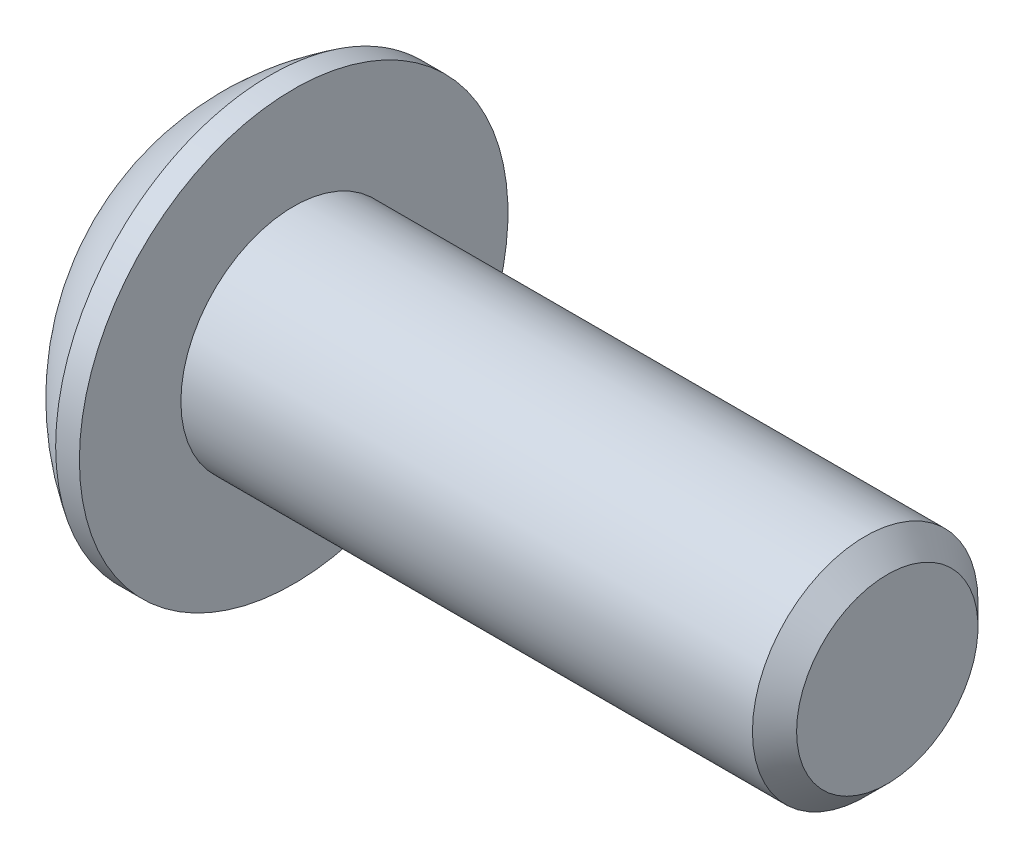
ISO-10303-21;
HEADER;
FILE_DESCRIPTION(('STEP AP214'),'2;1');
FILE_NAME('part.step','',(''),(''),'','','');
FILE_SCHEMA(('AUTOMOTIVE_DESIGN { 1 0 10303 214 1 1 1 1 }'));
ENDSEC;
DATA;
#1=APPLICATION_CONTEXT('core data for automotive mechanical design processes');
#2=APPLICATION_PROTOCOL_DEFINITION('international standard','automotive_design',2000,#1);
#3=PRODUCT_CONTEXT('',#1,'mechanical');
#4=PRODUCT('Part','Part','',(#3));
#5=PRODUCT_RELATED_PRODUCT_CATEGORY('part','',(#4));
#6=PRODUCT_DEFINITION_FORMATION('','',#4);
#7=PRODUCT_DEFINITION_CONTEXT('part definition',#1,'design');
#8=PRODUCT_DEFINITION('design','',#6,#7);
#9=PRODUCT_DEFINITION_SHAPE('','',#8);
#10=(LENGTH_UNIT() NAMED_UNIT(*) SI_UNIT(.MILLI.,.METRE.));
#11=(NAMED_UNIT(*) PLANE_ANGLE_UNIT() SI_UNIT($,.RADIAN.));
#12=(NAMED_UNIT(*) SI_UNIT($,.STERADIAN.) SOLID_ANGLE_UNIT());
#13=UNCERTAINTY_MEASURE_WITH_UNIT(LENGTH_MEASURE(1.E-05),#10,'distance_accuracy_value','');
#14=(GEOMETRIC_REPRESENTATION_CONTEXT(3) GLOBAL_UNCERTAINTY_ASSIGNED_CONTEXT((#13)) GLOBAL_UNIT_ASSIGNED_CONTEXT((#10,
#11,#12)) REPRESENTATION_CONTEXT('',''));
#15=CARTESIAN_POINT('',(0.,0.,0.));
#16=DIRECTION('',(0.,0.,1.));
#17=DIRECTION('',(1.,0.,0.));
#18=AXIS2_PLACEMENT_3D('',#15,#16,#17);
#19=CARTESIAN_POINT('',(1.77800000000017,0.,0.));
#20=DIRECTION('',(-1.,0.,0.));
#21=DIRECTION('',(0.,0.,1.));
#22=AXIS2_PLACEMENT_3D('',#19,#20,#21);
#23=CONICAL_SURFACE('',#22,1.58749999999985,1.04719755119662);
#24=CARTESIAN_POINT('',(2.69454355233856,0.,0.));
#25=VERTEX_POINT('',#24);
#26=VERTEX_LOOP('',#25);
#27=FACE_BOUND('',#26,.T.);
#28=CARTESIAN_POINT('',(1.77800000000017,0.,0.));
#29=DIRECTION('',(-1.,0.,0.));
#30=DIRECTION('',(0.,0.,1.));
#31=AXIS2_PLACEMENT_3D('',#28,#29,#30);
#32=CIRCLE('',#31,1.58749999999985);
#33=CARTESIAN_POINT('',(1.77800000000008,0.,1.58749999999993));
#34=VERTEX_POINT('',#33);
#35=CARTESIAN_POINT('',(1.77800000000008,-1.37481532850773,0.793749999999965));
#36=VERTEX_POINT('',#35);
#37=EDGE_CURVE('E19',#34,#36,#32,.F.);
#38=ORIENTED_EDGE('',*,*,#37,.F.);
#39=CARTESIAN_POINT('',(1.77800000000017,0.,0.));
#40=DIRECTION('',(-1.,0.,0.));
#41=DIRECTION('',(0.,0.,1.));
#42=AXIS2_PLACEMENT_3D('',#39,#40,#41);
#43=CIRCLE('',#42,1.58749999999985);
#44=CARTESIAN_POINT('',(1.77800000000008,1.37481532850773,0.793749999999963));
#45=VERTEX_POINT('',#44);
#46=EDGE_CURVE('E89',#34,#45,#43,.T.);
#47=ORIENTED_EDGE('',*,*,#46,.T.);
#48=CARTESIAN_POINT('',(1.77800000000017,0.,0.));
#49=DIRECTION('',(-1.,0.,0.));
#50=DIRECTION('',(0.,0.,1.));
#51=AXIS2_PLACEMENT_3D('',#48,#49,#50);
#52=CIRCLE('',#51,1.58749999999985);
#53=CARTESIAN_POINT('',(1.77800000000008,1.37481532850773,-0.793749999999963));
#54=VERTEX_POINT('',#53);
#55=EDGE_CURVE('E105',#45,#54,#52,.T.);
#56=ORIENTED_EDGE('',*,*,#55,.T.);
#57=CARTESIAN_POINT('',(1.77800000000017,0.,0.));
#58=DIRECTION('',(-1.,0.,0.));
#59=DIRECTION('',(0.,0.,1.));
#60=AXIS2_PLACEMENT_3D('',#57,#58,#59);
#61=CIRCLE('',#60,1.58749999999985);
#62=CARTESIAN_POINT('',(1.77800000000008,2.13833679173112E-12,-1.58749999999993));
#63=VERTEX_POINT('',#62);
#64=EDGE_CURVE('E448',#54,#63,#61,.T.);
#65=ORIENTED_EDGE('',*,*,#64,.T.);
#66=CARTESIAN_POINT('',(1.77800000000017,0.,0.));
#67=DIRECTION('',(-1.,0.,0.));
#68=DIRECTION('',(0.,0.,1.));
#69=AXIS2_PLACEMENT_3D('',#66,#67,#68);
#70=CIRCLE('',#69,1.58749999999985);
#71=CARTESIAN_POINT('',(1.77800000000008,-1.37481532850773,-0.793749999999965));
#72=VERTEX_POINT('',#71);
#73=EDGE_CURVE('E450',#72,#63,#70,.F.);
#74=ORIENTED_EDGE('',*,*,#73,.F.);
#75=CARTESIAN_POINT('',(1.77800000000017,0.,0.));
#76=DIRECTION('',(-1.,0.,0.));
#77=DIRECTION('',(0.,0.,1.));
#78=AXIS2_PLACEMENT_3D('',#75,#76,#77);
#79=CIRCLE('',#78,1.58749999999985);
#80=EDGE_CURVE('E92',#36,#72,#79,.F.);
#81=ORIENTED_EDGE('',*,*,#80,.F.);
#82=EDGE_LOOP('',(#38,#47,#56,#65,#74,#81));
#83=FACE_BOUND('',#82,.T.);
#84=ADVANCED_FACE('F16',(#27,#83),#23,.F.);
#85=CARTESIAN_POINT('',(1.778,-1.83308710467706,0.));
#86=DIRECTION('',(1.,0.,0.));
#87=DIRECTION('',(0.,0.,-1.));
#88=AXIS2_PLACEMENT_3D('',#85,#86,#87);
#89=PLANE('',#88);
#90=DIRECTION('',(0.,0.500000000000001,0.866025403784438));
#91=VECTOR('',#90,1.);
#92=CARTESIAN_POINT('',(1.778,-1.83308710467706,0.));
#93=LINE('',#92,#91);
#94=CARTESIAN_POINT('',(1.778,-0.91654355233853,1.5875));
#95=VERTEX_POINT('',#94);
#96=EDGE_CURVE('E110',#95,#36,#93,.F.);
#97=ORIENTED_EDGE('',*,*,#96,.F.);
#98=DIRECTION('',(0.,1.,0.));
#99=VECTOR('',#98,1.);
#100=CARTESIAN_POINT('',(1.778,-0.916543552338531,1.5875));
#101=LINE('',#100,#99);
#102=EDGE_CURVE('E108',#34,#95,#101,.F.);
#103=ORIENTED_EDGE('',*,*,#102,.F.);
#104=ORIENTED_EDGE('',*,*,#37,.T.);
#105=EDGE_LOOP('',(#97,#103,#104));
#106=FACE_BOUND('',#105,.T.);
#107=ADVANCED_FACE('F109',(#106),#89,.F.);
#108=CARTESIAN_POINT('',(1.778,-1.83308710467706,0.));
#109=DIRECTION('',(1.,0.,0.));
#110=DIRECTION('',(0.,0.,-1.));
#111=AXIS2_PLACEMENT_3D('',#108,#109,#110);
#112=PLANE('',#111);
#113=DIRECTION('',(0.,-0.500000000000001,0.866025403784438));
#114=VECTOR('',#113,1.);
#115=CARTESIAN_POINT('',(1.778,-0.916543552338531,-1.5875));
#116=LINE('',#115,#114);
#117=CARTESIAN_POINT('',(1.778,-1.83308710467706,0.));
#118=VERTEX_POINT('',#117);
#119=EDGE_CURVE('E158',#118,#72,#116,.F.);
#120=ORIENTED_EDGE('',*,*,#119,.F.);
#121=DIRECTION('',(0.,0.500000000000001,0.866025403784438));
#122=VECTOR('',#121,1.);
#123=CARTESIAN_POINT('',(1.778,-1.83308710467706,0.));
#124=LINE('',#123,#122);
#125=EDGE_CURVE('E170',#36,#118,#124,.F.);
#126=ORIENTED_EDGE('',*,*,#125,.F.);
#127=ORIENTED_EDGE('',*,*,#80,.T.);
#128=EDGE_LOOP('',(#120,#126,#127));
#129=FACE_BOUND('',#128,.T.);
#130=ADVANCED_FACE('F247',(#129),#112,.F.);
#131=CARTESIAN_POINT('',(1.778,-1.83308710467706,0.));
#132=DIRECTION('',(1.,0.,0.));
#133=DIRECTION('',(0.,0.,-1.));
#134=AXIS2_PLACEMENT_3D('',#131,#132,#133);
#135=PLANE('',#134);
#136=DIRECTION('',(0.,1.,0.));
#137=VECTOR('',#136,1.);
#138=CARTESIAN_POINT('',(1.778,0.91654355233853,-1.5875));
#139=LINE('',#138,#137);
#140=CARTESIAN_POINT('',(1.778,-0.916543552338531,-1.5875));
#141=VERTEX_POINT('',#140);
#142=EDGE_CURVE('E142',#141,#63,#139,.T.);
#143=ORIENTED_EDGE('',*,*,#142,.F.);
#144=DIRECTION('',(0.,-0.500000000000001,0.866025403784438));
#145=VECTOR('',#144,1.);
#146=CARTESIAN_POINT('',(1.778,-0.916543552338531,-1.5875));
#147=LINE('',#146,#145);
#148=EDGE_CURVE('E155',#72,#141,#147,.F.);
#149=ORIENTED_EDGE('',*,*,#148,.F.);
#150=ORIENTED_EDGE('',*,*,#73,.T.);
#151=EDGE_LOOP('',(#143,#149,#150));
#152=FACE_BOUND('',#151,.T.);
#153=ADVANCED_FACE('F243',(#152),#135,.F.);
#154=CARTESIAN_POINT('',(1.778,-1.83308710467706,0.));
#155=DIRECTION('',(1.,0.,0.));
#156=DIRECTION('',(0.,0.,-1.));
#157=AXIS2_PLACEMENT_3D('',#154,#155,#156);
#158=PLANE('',#157);
#159=DIRECTION('',(0.,-0.5,-0.866025403784439));
#160=VECTOR('',#159,1.);
#161=CARTESIAN_POINT('',(1.778,1.83308710467706,0.));
#162=LINE('',#161,#160);
#163=CARTESIAN_POINT('',(1.778,0.916543552338531,-1.5875));
#164=VERTEX_POINT('',#163);
#165=EDGE_CURVE('E127',#164,#54,#162,.F.);
#166=ORIENTED_EDGE('',*,*,#165,.F.);
#167=DIRECTION('',(0.,1.,0.));
#168=VECTOR('',#167,1.);
#169=CARTESIAN_POINT('',(1.778,0.91654355233853,-1.5875));
#170=LINE('',#169,#168);
#171=EDGE_CURVE('E139',#63,#164,#170,.T.);
#172=ORIENTED_EDGE('',*,*,#171,.F.);
#173=ORIENTED_EDGE('',*,*,#64,.F.);
#174=EDGE_LOOP('',(#166,#172,#173));
#175=FACE_BOUND('',#174,.T.);
#176=ADVANCED_FACE('F239',(#175),#158,.F.);
#177=CARTESIAN_POINT('',(1.778,-1.83308710467706,0.));
#178=DIRECTION('',(1.,0.,0.));
#179=DIRECTION('',(0.,0.,-1.));
#180=AXIS2_PLACEMENT_3D('',#177,#178,#179);
#181=PLANE('',#180);
#182=DIRECTION('',(0.,0.5,-0.866025403784439));
#183=VECTOR('',#182,1.);
#184=CARTESIAN_POINT('',(1.778,0.916543552338531,1.5875));
#185=LINE('',#184,#183);
#186=CARTESIAN_POINT('',(1.778,1.83308710467706,0.));
#187=VERTEX_POINT('',#186);
#188=EDGE_CURVE('E147',#187,#45,#185,.F.);
#189=ORIENTED_EDGE('',*,*,#188,.F.);
#190=DIRECTION('',(0.,-0.5,-0.866025403784439));
#191=VECTOR('',#190,1.);
#192=CARTESIAN_POINT('',(1.778,1.83308710467706,0.));
#193=LINE('',#192,#191);
#194=EDGE_CURVE('E124',#54,#187,#193,.F.);
#195=ORIENTED_EDGE('',*,*,#194,.F.);
#196=ORIENTED_EDGE('',*,*,#55,.F.);
#197=EDGE_LOOP('',(#189,#195,#196));
#198=FACE_BOUND('',#197,.T.);
#199=ADVANCED_FACE('F236',(#198),#181,.F.);
#200=CARTESIAN_POINT('',(1.778,-1.83308710467706,0.));
#201=DIRECTION('',(1.,0.,0.));
#202=DIRECTION('',(0.,0.,-1.));
#203=AXIS2_PLACEMENT_3D('',#200,#201,#202);
#204=PLANE('',#203);
#205=DIRECTION('',(0.,1.,0.));
#206=VECTOR('',#205,1.);
#207=CARTESIAN_POINT('',(1.778,-0.916543552338531,1.5875));
#208=LINE('',#207,#206);
#209=CARTESIAN_POINT('',(1.778,0.91654355233853,1.5875));
#210=VERTEX_POINT('',#209);
#211=EDGE_CURVE('E100',#210,#34,#208,.F.);
#212=ORIENTED_EDGE('',*,*,#211,.F.);
#213=DIRECTION('',(0.,0.5,-0.866025403784439));
#214=VECTOR('',#213,1.);
#215=CARTESIAN_POINT('',(1.778,0.916543552338531,1.5875));
#216=LINE('',#215,#214);
#217=EDGE_CURVE('E103',#45,#210,#216,.F.);
#218=ORIENTED_EDGE('',*,*,#217,.F.);
#219=ORIENTED_EDGE('',*,*,#46,.F.);
#220=EDGE_LOOP('',(#212,#218,#219));
#221=FACE_BOUND('',#220,.T.);
#222=ADVANCED_FACE('F98',(#221),#204,.F.);
#223=CARTESIAN_POINT('',(1.778,-0.916543552338531,1.5875));
#224=DIRECTION('',(0.,0.,-1.));
#225=DIRECTION('',(0.,1.,0.));
#226=AXIS2_PLACEMENT_3D('',#223,#224,#225);
#227=PLANE('',#226);
#228=DIRECTION('',(0.,1.,0.));
#229=VECTOR('',#228,1.);
#230=CARTESIAN_POINT('',(0.,0.,1.5875));
#231=LINE('',#230,#229);
#232=CARTESIAN_POINT('',(0.,0.91654355233853,1.5875));
#233=VERTEX_POINT('',#232);
#234=CARTESIAN_POINT('',(0.,-0.91654355233853,1.5875));
#235=VERTEX_POINT('',#234);
#236=EDGE_CURVE('E131',#233,#235,#231,.F.);
#237=ORIENTED_EDGE('',*,*,#236,.F.);
#238=DIRECTION('',(1.,0.,0.));
#239=VECTOR('',#238,1.);
#240=CARTESIAN_POINT('',(1.778,0.916543552338531,1.5875));
#241=LINE('',#240,#239);
#242=EDGE_CURVE('E116',#210,#233,#241,.F.);
#243=ORIENTED_EDGE('',*,*,#242,.F.);
#244=ORIENTED_EDGE('',*,*,#211,.T.);
#245=ORIENTED_EDGE('',*,*,#102,.T.);
#246=DIRECTION('',(1.,0.,0.));
#247=VECTOR('',#246,1.);
#248=CARTESIAN_POINT('',(1.778,-0.91654355233853,1.5875));
#249=LINE('',#248,#247);
#250=EDGE_CURVE('E167',#235,#95,#249,.T.);
#251=ORIENTED_EDGE('',*,*,#250,.F.);
#252=EDGE_LOOP('',(#237,#243,#244,#245,#251));
#253=FACE_BOUND('',#252,.T.);
#254=ADVANCED_FACE('F114',(#253),#227,.T.);
#255=CARTESIAN_POINT('',(1.778,-1.83308710467706,0.));
#256=DIRECTION('',(0.,0.866025403784438,-0.500000000000001));
#257=DIRECTION('',(0.,0.500000000000001,0.866025403784438));
#258=AXIS2_PLACEMENT_3D('',#255,#256,#257);
#259=PLANE('',#258);
#260=DIRECTION('',(0.,-0.500000000000001,-0.866025403784438));
#261=VECTOR('',#260,1.);
#262=CARTESIAN_POINT('',(0.,-0.916543552338531,1.5875));
#263=LINE('',#262,#261);
#264=CARTESIAN_POINT('',(0.,-1.83308710467706,0.));
#265=VERTEX_POINT('',#264);
#266=EDGE_CURVE('E434',#235,#265,#263,.T.);
#267=ORIENTED_EDGE('',*,*,#266,.F.);
#268=ORIENTED_EDGE('',*,*,#250,.T.);
#269=ORIENTED_EDGE('',*,*,#96,.T.);
#270=ORIENTED_EDGE('',*,*,#125,.T.);
#271=DIRECTION('',(1.,0.,0.));
#272=VECTOR('',#271,1.);
#273=CARTESIAN_POINT('',(1.778,-1.83308710467706,0.));
#274=LINE('',#273,#272);
#275=EDGE_CURVE('E152',#265,#118,#274,.T.);
#276=ORIENTED_EDGE('',*,*,#275,.F.);
#277=EDGE_LOOP('',(#267,#268,#269,#270,#276));
#278=FACE_BOUND('',#277,.T.);
#279=ADVANCED_FACE('F227',(#278),#259,.T.);
#280=CARTESIAN_POINT('',(1.778,-0.916543552338531,-1.5875));
#281=DIRECTION('',(0.,0.866025403784438,0.500000000000001));
#282=DIRECTION('',(0.,-0.500000000000001,0.866025403784438));
#283=AXIS2_PLACEMENT_3D('',#280,#281,#282);
#284=PLANE('',#283);
#285=DIRECTION('',(0.,0.500000000000001,-0.866025403784438));
#286=VECTOR('',#285,1.);
#287=CARTESIAN_POINT('',(0.,-1.83308710467706,0.));
#288=LINE('',#287,#286);
#289=CARTESIAN_POINT('',(0.,-0.916543552338531,-1.5875));
#290=VERTEX_POINT('',#289);
#291=EDGE_CURVE('E431',#265,#290,#288,.T.);
#292=ORIENTED_EDGE('',*,*,#291,.F.);
#293=ORIENTED_EDGE('',*,*,#275,.T.);
#294=ORIENTED_EDGE('',*,*,#119,.T.);
#295=ORIENTED_EDGE('',*,*,#148,.T.);
#296=DIRECTION('',(1.,0.,0.));
#297=VECTOR('',#296,1.);
#298=CARTESIAN_POINT('',(1.778,-0.916543552338531,-1.5875));
#299=LINE('',#298,#297);
#300=EDGE_CURVE('E136',#290,#141,#299,.T.);
#301=ORIENTED_EDGE('',*,*,#300,.F.);
#302=EDGE_LOOP('',(#292,#293,#294,#295,#301));
#303=FACE_BOUND('',#302,.T.);
#304=ADVANCED_FACE('F223',(#303),#284,.T.);
#305=CARTESIAN_POINT('',(1.778,0.91654355233853,-1.5875));
#306=DIRECTION('',(0.,0.,1.));
#307=DIRECTION('',(1.,0.,0.));
#308=AXIS2_PLACEMENT_3D('',#305,#306,#307);
#309=PLANE('',#308);
#310=DIRECTION('',(0.,1.,0.));
#311=VECTOR('',#310,1.);
#312=CARTESIAN_POINT('',(0.,0.,-1.5875));
#313=LINE('',#312,#311);
#314=CARTESIAN_POINT('',(0.,0.91654355233853,-1.5875));
#315=VERTEX_POINT('',#314);
#316=EDGE_CURVE('E428',#290,#315,#313,.T.);
#317=ORIENTED_EDGE('',*,*,#316,.F.);
#318=ORIENTED_EDGE('',*,*,#300,.T.);
#319=ORIENTED_EDGE('',*,*,#142,.T.);
#320=ORIENTED_EDGE('',*,*,#171,.T.);
#321=DIRECTION('',(1.,0.,0.));
#322=VECTOR('',#321,1.);
#323=CARTESIAN_POINT('',(1.778,0.91654355233853,-1.5875));
#324=LINE('',#323,#322);
#325=EDGE_CURVE('E126',#315,#164,#324,.T.);
#326=ORIENTED_EDGE('',*,*,#325,.F.);
#327=EDGE_LOOP('',(#317,#318,#319,#320,#326));
#328=FACE_BOUND('',#327,.T.);
#329=ADVANCED_FACE('F220',(#328),#309,.T.);
#330=CARTESIAN_POINT('',(1.778,1.83308710467706,0.));
#331=DIRECTION('',(0.,-0.866025403784439,0.5));
#332=DIRECTION('',(0.,-0.5,-0.866025403784439));
#333=AXIS2_PLACEMENT_3D('',#330,#331,#332);
#334=PLANE('',#333);
#335=DIRECTION('',(0.,0.5,0.866025403784439));
#336=VECTOR('',#335,1.);
#337=CARTESIAN_POINT('',(0.,0.91654355233853,-1.5875));
#338=LINE('',#337,#336);
#339=CARTESIAN_POINT('',(0.,1.83308710467706,0.));
#340=VERTEX_POINT('',#339);
#341=EDGE_CURVE('E425',#315,#340,#338,.T.);
#342=ORIENTED_EDGE('',*,*,#341,.F.);
#343=ORIENTED_EDGE('',*,*,#325,.T.);
#344=ORIENTED_EDGE('',*,*,#165,.T.);
#345=ORIENTED_EDGE('',*,*,#194,.T.);
#346=DIRECTION('',(1.,0.,0.));
#347=VECTOR('',#346,1.);
#348=CARTESIAN_POINT('',(1.778,1.83308710467706,0.));
#349=LINE('',#348,#347);
#350=EDGE_CURVE('E34',#340,#187,#349,.T.);
#351=ORIENTED_EDGE('',*,*,#350,.F.);
#352=EDGE_LOOP('',(#342,#343,#344,#345,#351));
#353=FACE_BOUND('',#352,.T.);
#354=ADVANCED_FACE('F216',(#353),#334,.T.);
#355=CARTESIAN_POINT('',(1.778,0.916543552338531,1.5875));
#356=DIRECTION('',(0.,-0.866025403784439,-0.5));
#357=DIRECTION('',(0.,0.5,-0.866025403784439));
#358=AXIS2_PLACEMENT_3D('',#355,#356,#357);
#359=PLANE('',#358);
#360=DIRECTION('',(0.,-0.5,0.866025403784439));
#361=VECTOR('',#360,1.);
#362=CARTESIAN_POINT('',(0.,1.83308710467706,0.));
#363=LINE('',#362,#361);
#364=EDGE_CURVE('E202',#340,#233,#363,.T.);
#365=ORIENTED_EDGE('',*,*,#364,.F.);
#366=ORIENTED_EDGE('',*,*,#350,.T.);
#367=ORIENTED_EDGE('',*,*,#188,.T.);
#368=ORIENTED_EDGE('',*,*,#217,.T.);
#369=ORIENTED_EDGE('',*,*,#242,.T.);
#370=EDGE_LOOP('',(#365,#366,#367,#368,#369));
#371=FACE_BOUND('',#370,.T.);
#372=ADVANCED_FACE('F212',(#371),#359,.T.);
#373=CARTESIAN_POINT('',(0.,0.,0.));
#374=DIRECTION('',(-1.,0.,0.));
#375=DIRECTION('',(0.,0.,1.));
#376=AXIS2_PLACEMENT_3D('',#373,#374,#375);
#377=PLANE('',#376);
#378=ORIENTED_EDGE('',*,*,#341,.T.);
#379=ORIENTED_EDGE('',*,*,#364,.T.);
#380=ORIENTED_EDGE('',*,*,#236,.T.);
#381=ORIENTED_EDGE('',*,*,#266,.T.);
#382=ORIENTED_EDGE('',*,*,#291,.T.);
#383=ORIENTED_EDGE('',*,*,#316,.T.);
#384=EDGE_LOOP('',(#378,#379,#380,#381,#382,#383));
#385=FACE_BOUND('',#384,.T.);
#386=CARTESIAN_POINT('',(0.,2.29235,0.));
#387=CARTESIAN_POINT('',(0.,2.29234961429956,0.0643619991867156));
#388=CARTESIAN_POINT('',(0.,2.28963695190107,0.128735826629365));
#389=CARTESIAN_POINT('',(0.,2.27880393843647,0.257038618985286));
#390=CARTESIAN_POINT('',(0.,2.27068199085126,0.320967446929162));
#391=CARTESIAN_POINT('',(0.,2.24906694794255,0.448021254607716));
#392=CARTESIAN_POINT('',(-2.10473483966727E-13,2.2355653265346,0.511144793381859));
#393=CARTESIAN_POINT('',(2.11512355009136E-13,2.20328400495643,0.636065176149319));
#394=CARTESIAN_POINT('',(7.88547714490058E-13,2.18450002159113,0.697860899533932));
#395=CARTESIAN_POINT('',(1.31038865418015E-12,2.12048422735802,0.880329802927745));
#396=CARTESIAN_POINT('',(0.,2.06753599079458,0.998391795928114));
#397=CARTESIAN_POINT('',(0.,1.94254204858672,1.22393765942147));
#398=CARTESIAN_POINT('',(1.0944863984612E-12,1.87049561696642,1.33142112758208));
#399=CARTESIAN_POINT('',(6.78157167000121E-13,1.7497425419488,1.48237719670935));
#400=CARTESIAN_POINT('',(1.81954057270124E-13,1.707345731323,1.53101280076737));
#401=CARTESIAN_POINT('',(-1.80911682549526E-13,1.61863910291528,1.62450601319184));
#402=CARTESIAN_POINT('',(0.,1.57233309727312,1.66936721890417));
#403=CARTESIAN_POINT('',(0.,1.47608431707233,1.7550488420402));
#404=CARTESIAN_POINT('',(0.,1.42613990458993,1.79586741981511));
#405=CARTESIAN_POINT('',(0.,1.3229945254125,1.87315615311522));
#406=CARTESIAN_POINT('',(0.,1.26979280714187,1.90962529930696));
#407=CARTESIAN_POINT('',(0.,1.10588180153952,2.01207722151089));
#408=CARTESIAN_POINT('',(0.,0.990764947001308,2.07119486286666));
#409=CARTESIAN_POINT('',(0.,0.752302198839713,2.16922858468855));
#410=CARTESIAN_POINT('',(0.,0.628956393121256,2.20814488091449));
#411=CARTESIAN_POINT('',(0.,0.377466101733266,2.26472755765919));
#412=CARTESIAN_POINT('',(0.,0.249321590440377,2.28239382469378));
#413=CARTESIAN_POINT('',(0.,-0.00811435371610854,2.29595665980955));
#414=CARTESIAN_POINT('',(0.,-0.137405786579706,2.29185322789072));
#415=CARTESIAN_POINT('',(0.,-0.393449386933725,2.26200962409059));
#416=CARTESIAN_POINT('',(0.,-0.520201567981082,2.23626956775766));
#417=CARTESIAN_POINT('',(0.,-0.767645294384449,2.16383549332686));
#418=CARTESIAN_POINT('',(0.,-0.888336774993553,2.11714125142684));
#419=CARTESIAN_POINT('',(0.,-1.06210572146656,2.03247976453653));
#420=CARTESIAN_POINT('',(0.,-1.11884498714066,2.00180278323694));
#421=CARTESIAN_POINT('',(0.,-1.22954062855573,1.93578011658035));
#422=CARTESIAN_POINT('',(0.,-1.28349764565393,1.9004355139425));
#423=CARTESIAN_POINT('',(0.,-1.38821676641538,1.82534174602347));
#424=CARTESIAN_POINT('',(0.,-1.43898030563029,1.78559458231503));
#425=CARTESIAN_POINT('',(0.,-1.53701984534431,1.70193996292361));
#426=CARTESIAN_POINT('',(0.,-1.58429243280551,1.65802852924126));
#427=CARTESIAN_POINT('',(0.,-1.72023903553758,1.52059650554138));
#428=CARTESIAN_POINT('',(0.,-1.80318066138239,1.42127847626519));
#429=CARTESIAN_POINT('',(0.,-1.95118232345098,1.21011519784663));
#430=CARTESIAN_POINT('',(0.,-2.01624303935584,1.09827042509272));
#431=CARTESIAN_POINT('',(0.,-2.09907772661315,0.923538238005834));
#432=CARTESIAN_POINT('',(0.,-2.12425103063558,0.864058373981962));
#433=CARTESIAN_POINT('',(0.,-2.16947990046565,0.743221562175597));
#434=CARTESIAN_POINT('',(0.,-2.18953960800684,0.681866178863361));
#435=CARTESIAN_POINT('',(0.,-2.22438542051156,0.557786972400354));
#436=CARTESIAN_POINT('',(0.,-2.23917985294818,0.495065478128169));
#437=CARTESIAN_POINT('',(0.,-2.26343456384453,0.368611258323513));
#438=CARTESIAN_POINT('',(0.,-2.27289641559286,0.304878836759567));
#439=CARTESIAN_POINT('',(0.,-2.28388649696736,0.200873029360624));
#440=CARTESIAN_POINT('',(0.,-2.28705930623293,0.160766164180097));
#441=CARTESIAN_POINT('',(0.,-2.29129117827044,0.0804410725432706));
#442=CARTESIAN_POINT('',(0.,-2.29235024104238,0.0402228460869713));
#443=CARTESIAN_POINT('',(0.,-2.29234961429957,-0.0643619991867166));
#444=CARTESIAN_POINT('',(0.,-2.28963695190107,-0.128735826629366));
#445=CARTESIAN_POINT('',(0.,-2.27880393843647,-0.257038618985287));
#446=CARTESIAN_POINT('',(0.,-2.27068199085126,-0.320967446929163));
#447=CARTESIAN_POINT('',(0.,-2.24906694794255,-0.448021254607718));
#448=CARTESIAN_POINT('',(-2.10776055808131E-13,-2.2355653265346,-0.511144793381862));
#449=CARTESIAN_POINT('',(2.11815172901383E-13,-2.20328400495643,-0.636065176149322));
#450=CARTESIAN_POINT('',(7.89841960011606E-13,-2.18450002159113,-0.697860899533935));
#451=CARTESIAN_POINT('',(1.31300223385862E-12,-2.12048422735802,-0.880329802927749));
#452=CARTESIAN_POINT('',(0.,-2.06753599079458,-0.998391795928116));
#453=CARTESIAN_POINT('',(0.,-1.94254204858672,-1.22393765942147));
#454=CARTESIAN_POINT('',(1.09190336088254E-12,-1.87049561696642,-1.33142112758208));
#455=CARTESIAN_POINT('',(6.76847156379684E-13,-1.74974254194879,-1.48237719670935));
#456=CARTESIAN_POINT('',(1.81603200486814E-13,-1.707345731323,-1.53101280076737));
#457=CARTESIAN_POINT('',(-1.80561164044999E-13,-1.61863910291528,-1.62450601319185));
#458=CARTESIAN_POINT('',(0.,-1.57233309727312,-1.66936721890417));
#459=CARTESIAN_POINT('',(0.,-1.47608431707233,-1.7550488420402));
#460=CARTESIAN_POINT('',(0.,-1.42613990458993,-1.79586741981511));
#461=CARTESIAN_POINT('',(0.,-1.3229945254125,-1.87315615311522));
#462=CARTESIAN_POINT('',(0.,-1.26979280714187,-1.90962529930697));
#463=CARTESIAN_POINT('',(0.,-1.10588180153952,-2.0120772215109));
#464=CARTESIAN_POINT('',(0.,-0.990764947001305,-2.07119486286666));
#465=CARTESIAN_POINT('',(0.,-0.752302198839709,-2.16922858468855));
#466=CARTESIAN_POINT('',(0.,-0.628956393121251,-2.20814488091449));
#467=CARTESIAN_POINT('',(0.,-0.377466101733262,-2.26472755765919));
#468=CARTESIAN_POINT('',(0.,-0.249321590440373,-2.28239382469378));
#469=CARTESIAN_POINT('',(0.,0.00811435371611301,-2.29595665980954));
#470=CARTESIAN_POINT('',(0.,0.13740578657971,-2.29185322789071));
#471=CARTESIAN_POINT('',(0.,0.393449386933729,-2.26200962409059));
#472=CARTESIAN_POINT('',(0.,0.520201567981087,-2.23626956775765));
#473=CARTESIAN_POINT('',(0.,0.767645294384454,-2.16383549332687));
#474=CARTESIAN_POINT('',(0.,0.888336774993558,-2.11714125142685));
#475=CARTESIAN_POINT('',(0.,1.06210572146656,-2.03247976453653));
#476=CARTESIAN_POINT('',(0.,1.11884498714067,-2.00180278323694));
#477=CARTESIAN_POINT('',(0.,1.22954062855573,-1.93578011658035));
#478=CARTESIAN_POINT('',(0.,1.28349764565393,-1.90043551394249));
#479=CARTESIAN_POINT('',(0.,1.38821676641538,-1.82534174602347));
#480=CARTESIAN_POINT('',(0.,1.43898030563029,-1.78559458231502));
#481=CARTESIAN_POINT('',(0.,1.53701984534431,-1.70193996292361));
#482=CARTESIAN_POINT('',(0.,1.58429243280551,-1.65802852924126));
#483=CARTESIAN_POINT('',(0.,1.72023903553758,-1.52059650554138));
#484=CARTESIAN_POINT('',(0.,1.80318066138239,-1.42127847626519));
#485=CARTESIAN_POINT('',(0.,1.95118232345098,-1.21011519784663));
#486=CARTESIAN_POINT('',(0.,2.01624303935584,-1.09827042509271));
#487=CARTESIAN_POINT('',(0.,2.09907772661314,-0.923538238005831));
#488=CARTESIAN_POINT('',(0.,2.12425103063558,-0.864058373981959));
#489=CARTESIAN_POINT('',(0.,2.16947990046565,-0.743221562175594));
#490=CARTESIAN_POINT('',(0.,2.18953960800684,-0.681866178863358));
#491=CARTESIAN_POINT('',(0.,2.22438542051156,-0.55778697240035));
#492=CARTESIAN_POINT('',(0.,2.23917985294818,-0.495065478128167));
#493=CARTESIAN_POINT('',(0.,2.26343456384453,-0.368611258323511));
#494=CARTESIAN_POINT('',(0.,2.27289641559285,-0.304878836759565));
#495=CARTESIAN_POINT('',(0.,2.28388649696736,-0.200873029360621));
#496=CARTESIAN_POINT('',(0.,2.28705930623293,-0.160766164180095));
#497=CARTESIAN_POINT('',(0.,2.29129117827044,-0.0804410725432706));
#498=CARTESIAN_POINT('',(0.,2.29235024104238,-0.0402228460869719));
#499=CARTESIAN_POINT('',(0.,2.29235,0.));
#500=B_SPLINE_CURVE_WITH_KNOTS('',3,(#386,#387,#388,#389,#390,#391,#392,#393,#394,#395,#396,
#397,#398,#399,#400,#401,#402,#403,#404,#405,#406,#407,#408,#409,#410,#411,#412,#413,#414,#415,
#416,#417,#418,#419,#420,#421,#422,#423,#424,#425,#426,#427,#428,#429,#430,#431,#432,#433,#434,
#435,#436,#437,#438,#439,#440,#441,#442,#443,#444,#445,#446,#447,#448,#449,#450,#451,#452,#453,
#454,#455,#456,#457,#458,#459,#460,#461,#462,#463,#464,#465,#466,#467,#468,#469,#470,#471,#472,
#473,#474,#475,#476,#477,#478,#479,#480,#481,#482,#483,#484,#485,#486,#487,#488,#489,#490,#491,
#492,#493,#494,#495,#496,#497,#498,#499),.UNSPECIFIED.,.T.,.F.,(4,2,2,2,2,2,2,2,2,2,2,2,2,2,2,2,
2,2,2,2,2,2,2,2,2,2,2,2,2,2,2,2,2,2,2,2,2,2,2,2,2,2,2,2,2,2,2,2,2,2,2,2,2,2,2,2,4),(0.,
0.193048968618033,0.386154939782394,0.579568183995957,0.773138711491037,1.15935703864577,
1.54559004914644,1.73895960916368,1.93214273180063,2.12541336477221,2.31872876140888,
2.70495649282618,3.09118009906582,3.47740576789431,3.86363143672284,4.24985504296252,
4.63608277437978,4.82939817101618,5.02266880398747,5.21585192662418,5.40922148664121,
5.79545449714215,6.18167282429723,6.3752433517926,6.5686565960064,6.76176256717087,
6.95481153578906,7.0754569329192,7.19610233004935,7.38915129866738,7.58225726983174,
7.77567051404531,7.96924104154039,8.35545936869512,8.7416923791958,8.93506193921303,
9.12824506184998,9.32151569482156,9.51483109145823,9.90105882287553,10.2872824291152,
10.6735080979437,11.0597337667722,11.4459573730119,11.8321851044291,12.0255005010655,
12.2187711340368,12.4119542566735,12.6053238166906,12.9915568271915,13.3777751543466,
13.5713456818419,13.7647589260557,13.9578648972202,14.1509138658384,14.2715592629685,
14.3922046600987),.UNSPECIFIED.);
#501=CARTESIAN_POINT('',(0.,2.29235,0.));
#502=VERTEX_POINT('',#501);
#503=EDGE_CURVE('E196',#502,#502,#500,.T.);
#504=ORIENTED_EDGE('',*,*,#503,.F.);
#505=EDGE_LOOP('',(#504));
#506=FACE_BOUND('',#505,.T.);
#507=ADVANCED_FACE('F208',(#385,#506),#377,.T.);
#508=CARTESIAN_POINT('',(4.85989606481482,0.,0.));
#509=DIRECTION('',(0.,1.,0.));
#510=DIRECTION('',(1.,0.,0.));
#511=AXIS2_PLACEMENT_3D('',#508,#509,#510);
#512=SPHERICAL_SURFACE('',#511,5.37340285883187);
#513=CARTESIAN_POINT('',(2.0574,0.,0.));
#514=DIRECTION('',(-1.,0.,0.));
#515=DIRECTION('',(0.,0.,1.));
#516=AXIS2_PLACEMENT_3D('',#513,#514,#515);
#517=CIRCLE('',#516,4.5847);
#518=CARTESIAN_POINT('',(2.0574,0.,4.5847));
#519=VERTEX_POINT('',#518);
#520=EDGE_CURVE('E193',#519,#519,#517,.F.);
#521=ORIENTED_EDGE('',*,*,#520,.F.);
#522=EDGE_LOOP('',(#521));
#523=FACE_BOUND('',#522,.T.);
#524=ORIENTED_EDGE('',*,*,#503,.T.);
#525=EDGE_LOOP('',(#524));
#526=FACE_BOUND('',#525,.T.);
#527=ADVANCED_FACE('F204',(#523,#526),#512,.T.);
#528=CARTESIAN_POINT('',(15.2654,0.,0.));
#529=DIRECTION('',(-1.,0.,0.));
#530=DIRECTION('',(0.,0.,1.));
#531=AXIS2_PLACEMENT_3D('',#528,#529,#530);
#532=PLANE('',#531);
#533=CARTESIAN_POINT('',(15.2653999999757,0.,0.));
#534=DIRECTION('',(-1.,0.,0.));
#535=DIRECTION('',(0.,0.,1.));
#536=AXIS2_PLACEMENT_3D('',#533,#534,#535);
#537=CIRCLE('',#536,1.94055999992315);
#538=CARTESIAN_POINT('',(15.2653999999757,0.,1.94055999992315));
#539=VERTEX_POINT('',#538);
#540=EDGE_CURVE('E190',#539,#539,#537,.T.);
#541=ORIENTED_EDGE('',*,*,#540,.F.);
#542=EDGE_LOOP('',(#541));
#543=FACE_BOUND('',#542,.T.);
#544=ADVANCED_FACE('F275',(#543),#532,.F.);
#545=CARTESIAN_POINT('',(0.,0.,0.));
#546=DIRECTION('',(-1.,0.,0.));
#547=DIRECTION('',(0.,0.,1.));
#548=AXIS2_PLACEMENT_3D('',#545,#546,#547);
#549=CYLINDRICAL_SURFACE('',#548,4.5847);
#550=ORIENTED_EDGE('',*,*,#520,.T.);
#551=EDGE_LOOP('',(#550));
#552=FACE_BOUND('',#551,.T.);
#553=CARTESIAN_POINT('',(2.5654,0.,0.));
#554=DIRECTION('',(-1.,0.,0.));
#555=DIRECTION('',(0.,0.,1.));
#556=AXIS2_PLACEMENT_3D('',#553,#554,#555);
#557=CIRCLE('',#556,4.5847);
#558=CARTESIAN_POINT('',(2.5654,0.,4.5847));
#559=VERTEX_POINT('',#558);
#560=EDGE_CURVE('E187',#559,#559,#557,.T.);
#561=ORIENTED_EDGE('',*,*,#560,.T.);
#562=EDGE_LOOP('',(#561));
#563=FACE_BOUND('',#562,.T.);
#564=ADVANCED_FACE('F272',(#552,#563),#549,.T.);
#565=CARTESIAN_POINT('',(14.7929599999657,0.,0.));
#566=DIRECTION('',(-1.,0.,0.));
#567=DIRECTION('',(0.,0.,1.));
#568=AXIS2_PLACEMENT_3D('',#565,#566,#567);
#569=CONICAL_SURFACE('',#568,2.41299999999001,0.785398163457608);
#570=CARTESIAN_POINT('',(14.79296,0.,0.));
#571=DIRECTION('',(-1.,0.,0.));
#572=DIRECTION('',(0.,0.,1.));
#573=AXIS2_PLACEMENT_3D('',#570,#571,#572);
#574=CIRCLE('',#573,2.413);
#575=CARTESIAN_POINT('',(14.79296,0.,2.413));
#576=VERTEX_POINT('',#575);
#577=EDGE_CURVE('E25',#576,#576,#574,.T.);
#578=ORIENTED_EDGE('',*,*,#577,.F.);
#579=EDGE_LOOP('',(#578));
#580=FACE_BOUND('',#579,.T.);
#581=ORIENTED_EDGE('',*,*,#540,.T.);
#582=EDGE_LOOP('',(#581));
#583=FACE_BOUND('',#582,.T.);
#584=ADVANCED_FACE('F265',(#580,#583),#569,.T.);
#585=CARTESIAN_POINT('',(2.5654,2.413,0.));
#586=DIRECTION('',(-1.,0.,0.));
#587=DIRECTION('',(0.,0.,1.));
#588=AXIS2_PLACEMENT_3D('',#585,#586,#587);
#589=PLANE('',#588);
#590=CARTESIAN_POINT('',(2.5654,0.,0.));
#591=DIRECTION('',(-1.,0.,0.));
#592=DIRECTION('',(0.,0.,1.));
#593=AXIS2_PLACEMENT_3D('',#590,#591,#592);
#594=CIRCLE('',#593,2.413);
#595=CARTESIAN_POINT('',(2.5654,0.,2.413));
#596=VERTEX_POINT('',#595);
#597=EDGE_CURVE('E11',#596,#596,#594,.F.);
#598=ORIENTED_EDGE('',*,*,#597,.F.);
#599=EDGE_LOOP('',(#598));
#600=FACE_BOUND('',#599,.T.);
#601=ORIENTED_EDGE('',*,*,#560,.F.);
#602=EDGE_LOOP('',(#601));
#603=FACE_BOUND('',#602,.T.);
#604=ADVANCED_FACE('F259',(#600,#603),#589,.F.);
#605=CARTESIAN_POINT('',(0.,0.,0.));
#606=DIRECTION('',(-1.,0.,0.));
#607=DIRECTION('',(0.,0.,1.));
#608=AXIS2_PLACEMENT_3D('',#605,#606,#607);
#609=CYLINDRICAL_SURFACE('',#608,2.413);
#610=ORIENTED_EDGE('',*,*,#597,.T.);
#611=EDGE_LOOP('',(#610));
#612=FACE_BOUND('',#611,.T.);
#613=ORIENTED_EDGE('',*,*,#577,.T.);
#614=EDGE_LOOP('',(#613));
#615=FACE_BOUND('',#614,.T.);
#616=ADVANCED_FACE('F257',(#612,#615),#609,.T.);
#617=CLOSED_SHELL('',(#84,#107,#130,#153,#176,#199,#222,#254,#279,#304,#329,#354,#372,#507,#527,
#544,#564,#584,#604,#616));
#618=MANIFOLD_SOLID_BREP('B1',#617);
#619=ADVANCED_BREP_SHAPE_REPRESENTATION('',(#18,#618),#14);
#620=SHAPE_DEFINITION_REPRESENTATION(#9,#619);
ENDSEC;
END-ISO-10303-21;
